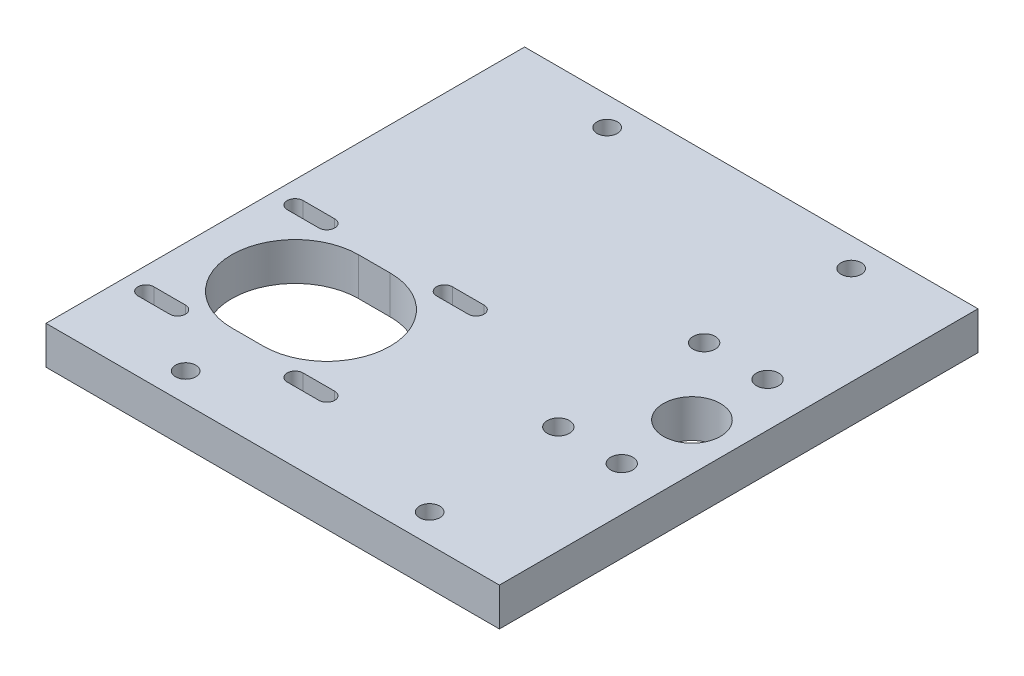
ISO-10303-21;
HEADER;
FILE_DESCRIPTION(('STEP AP214'),'2;1');
FILE_NAME('part.step','',(''),(''),'','','');
FILE_SCHEMA(('AUTOMOTIVE_DESIGN { 1 0 10303 214 1 1 1 1 }'));
ENDSEC;
DATA;
#1=APPLICATION_CONTEXT('core data for automotive mechanical design processes');
#2=APPLICATION_PROTOCOL_DEFINITION('international standard','automotive_design',2000,#1);
#3=PRODUCT_CONTEXT('',#1,'mechanical');
#4=PRODUCT('Part','Part','',(#3));
#5=PRODUCT_RELATED_PRODUCT_CATEGORY('part','',(#4));
#6=PRODUCT_DEFINITION_FORMATION('','',#4);
#7=PRODUCT_DEFINITION_CONTEXT('part definition',#1,'design');
#8=PRODUCT_DEFINITION('design','',#6,#7);
#9=PRODUCT_DEFINITION_SHAPE('','',#8);
#10=(LENGTH_UNIT() NAMED_UNIT(*) SI_UNIT(.MILLI.,.METRE.));
#11=(NAMED_UNIT(*) PLANE_ANGLE_UNIT() SI_UNIT($,.RADIAN.));
#12=(NAMED_UNIT(*) SI_UNIT($,.STERADIAN.) SOLID_ANGLE_UNIT());
#13=UNCERTAINTY_MEASURE_WITH_UNIT(LENGTH_MEASURE(1.E-05),#10,'distance_accuracy_value','');
#14=(GEOMETRIC_REPRESENTATION_CONTEXT(3) GLOBAL_UNCERTAINTY_ASSIGNED_CONTEXT((#13)) GLOBAL_UNIT_ASSIGNED_CONTEXT((#10,
#11,#12)) REPRESENTATION_CONTEXT('',''));
#15=CARTESIAN_POINT('',(0.,0.,0.));
#16=DIRECTION('',(0.,0.,1.));
#17=DIRECTION('',(1.,0.,0.));
#18=AXIS2_PLACEMENT_3D('',#15,#16,#17);
#19=CARTESIAN_POINT('',(-73.5,12.,-75.5));
#20=DIRECTION('',(0.,0.,1.));
#21=DIRECTION('',(1.,0.,0.));
#22=AXIS2_PLACEMENT_3D('',#19,#20,#21);
#23=PLANE('',#22);
#24=DIRECTION('',(-1.,0.,0.));
#25=VECTOR('',#24,1.);
#26=CARTESIAN_POINT('',(-73.5,12.,-75.5));
#27=LINE('',#26,#25);
#28=CARTESIAN_POINT('',(54.55,12.,-75.5));
#29=VERTEX_POINT('',#28);
#30=CARTESIAN_POINT('',(-88.5,12.,-75.5));
#31=VERTEX_POINT('',#30);
#32=EDGE_CURVE('E41',#29,#31,#27,.T.);
#33=ORIENTED_EDGE('',*,*,#32,.F.);
#34=DIRECTION('',(0.,1.,0.));
#35=VECTOR('',#34,1.);
#36=CARTESIAN_POINT('',(54.55,0.,-75.5));
#37=LINE('',#36,#35);
#38=CARTESIAN_POINT('',(54.55,0.,-75.5));
#39=VERTEX_POINT('',#38);
#40=EDGE_CURVE('E195',#39,#29,#37,.T.);
#41=ORIENTED_EDGE('',*,*,#40,.F.);
#42=DIRECTION('',(-1.,0.,0.));
#43=VECTOR('',#42,1.);
#44=CARTESIAN_POINT('',(-73.5,0.,-75.5));
#45=LINE('',#44,#43);
#46=CARTESIAN_POINT('',(-88.5,0.,-75.5));
#47=VERTEX_POINT('',#46);
#48=EDGE_CURVE('E205',#39,#47,#45,.T.);
#49=ORIENTED_EDGE('',*,*,#48,.T.);
#50=DIRECTION('',(0.,1.,0.));
#51=VECTOR('',#50,1.);
#52=CARTESIAN_POINT('',(-88.5,0.,-75.5));
#53=LINE('',#52,#51);
#54=EDGE_CURVE('E246',#47,#31,#53,.T.);
#55=ORIENTED_EDGE('',*,*,#54,.T.);
#56=EDGE_LOOP('',(#33,#41,#49,#55));
#57=FACE_BOUND('',#56,.T.);
#58=ADVANCED_FACE('F33',(#57),#23,.F.);
#59=CARTESIAN_POINT('',(-73.5,12.,75.5));
#60=DIRECTION('',(0.,0.,-1.));
#61=DIRECTION('',(-1.,0.,0.));
#62=AXIS2_PLACEMENT_3D('',#59,#60,#61);
#63=PLANE('',#62);
#64=DIRECTION('',(1.,0.,0.));
#65=VECTOR('',#64,1.);
#66=CARTESIAN_POINT('',(-73.5,0.,75.5));
#67=LINE('',#66,#65);
#68=CARTESIAN_POINT('',(-88.5,0.,75.5));
#69=VERTEX_POINT('',#68);
#70=CARTESIAN_POINT('',(54.55,0.,75.5));
#71=VERTEX_POINT('',#70);
#72=EDGE_CURVE('E36',#69,#71,#67,.T.);
#73=ORIENTED_EDGE('',*,*,#72,.T.);
#74=DIRECTION('',(0.,1.,0.));
#75=VECTOR('',#74,1.);
#76=CARTESIAN_POINT('',(54.55,0.,75.5));
#77=LINE('',#76,#75);
#78=CARTESIAN_POINT('',(54.55,12.,75.5));
#79=VERTEX_POINT('',#78);
#80=EDGE_CURVE('E49',#71,#79,#77,.T.);
#81=ORIENTED_EDGE('',*,*,#80,.T.);
#82=DIRECTION('',(1.,0.,0.));
#83=VECTOR('',#82,1.);
#84=CARTESIAN_POINT('',(-73.5,12.,75.5));
#85=LINE('',#84,#83);
#86=CARTESIAN_POINT('',(-88.5,12.,75.5));
#87=VERTEX_POINT('',#86);
#88=EDGE_CURVE('E11',#87,#79,#85,.T.);
#89=ORIENTED_EDGE('',*,*,#88,.F.);
#90=DIRECTION('',(0.,1.,0.));
#91=VECTOR('',#90,1.);
#92=CARTESIAN_POINT('',(-88.5,0.,75.5));
#93=LINE('',#92,#91);
#94=EDGE_CURVE('E226',#69,#87,#93,.T.);
#95=ORIENTED_EDGE('',*,*,#94,.F.);
#96=EDGE_LOOP('',(#73,#81,#89,#95));
#97=FACE_BOUND('',#96,.T.);
#98=ADVANCED_FACE('F451',(#97),#63,.F.);
#99=CARTESIAN_POINT('',(0.,12.,0.));
#100=DIRECTION('',(0.,-1.,0.));
#101=DIRECTION('',(0.,0.,-1.));
#102=AXIS2_PLACEMENT_3D('',#99,#100,#101);
#103=PLANE('',#102);
#104=CARTESIAN_POINT('',(-53.45,12.,66.5));
#105=DIRECTION('',(0.,1.,0.));
#106=DIRECTION('',(0.,0.,1.));
#107=AXIS2_PLACEMENT_3D('',#104,#105,#106);
#108=CIRCLE('',#107,3.19999999999999);
#109=CARTESIAN_POINT('',(-53.45,12.,69.7));
#110=VERTEX_POINT('',#109);
#111=EDGE_CURVE('E433',#110,#110,#108,.T.);
#112=ORIENTED_EDGE('',*,*,#111,.F.);
#113=EDGE_LOOP('',(#112));
#114=FACE_BOUND('',#113,.T.);
#115=CARTESIAN_POINT('',(-53.45,12.,-66.5));
#116=DIRECTION('',(0.,1.,0.));
#117=DIRECTION('',(0.,0.,-1.));
#118=AXIS2_PLACEMENT_3D('',#115,#116,#117);
#119=CIRCLE('',#118,3.19999999999999);
#120=CARTESIAN_POINT('',(-53.45,12.,-69.7));
#121=VERTEX_POINT('',#120);
#122=EDGE_CURVE('E427',#121,#121,#119,.T.);
#123=ORIENTED_EDGE('',*,*,#122,.F.);
#124=EDGE_LOOP('',(#123));
#125=FACE_BOUND('',#124,.T.);
#126=CARTESIAN_POINT('',(23.55,12.,-66.5));
#127=DIRECTION('',(0.,1.,0.));
#128=DIRECTION('',(0.,0.,-1.));
#129=AXIS2_PLACEMENT_3D('',#126,#127,#128);
#130=CIRCLE('',#129,3.2);
#131=CARTESIAN_POINT('',(23.55,12.,-69.7));
#132=VERTEX_POINT('',#131);
#133=EDGE_CURVE('E421',#132,#132,#130,.T.);
#134=ORIENTED_EDGE('',*,*,#133,.F.);
#135=EDGE_LOOP('',(#134));
#136=FACE_BOUND('',#135,.T.);
#137=CARTESIAN_POINT('',(23.55,12.,66.5));
#138=DIRECTION('',(0.,1.,0.));
#139=DIRECTION('',(0.,0.,1.));
#140=AXIS2_PLACEMENT_3D('',#137,#138,#139);
#141=CIRCLE('',#140,3.2);
#142=CARTESIAN_POINT('',(23.55,12.,69.7));
#143=VERTEX_POINT('',#142);
#144=EDGE_CURVE('E415',#143,#143,#141,.T.);
#145=ORIENTED_EDGE('',*,*,#144,.F.);
#146=EDGE_LOOP('',(#145));
#147=FACE_BOUND('',#146,.T.);
#148=DIRECTION('',(-1.,0.,0.));
#149=VECTOR('',#148,1.);
#150=CARTESIAN_POINT('',(-34.4,12.,53.5));
#151=LINE('',#150,#149);
#152=CARTESIAN_POINT('',(-24.4,12.,53.5));
#153=VERTEX_POINT('',#152);
#154=CARTESIAN_POINT('',(-34.4,12.,53.5));
#155=VERTEX_POINT('',#154);
#156=EDGE_CURVE('E355',#153,#155,#151,.T.);
#157=ORIENTED_EDGE('',*,*,#156,.T.);
#158=CARTESIAN_POINT('',(-34.4,12.,51.));
#159=DIRECTION('',(0.,-1.,0.));
#160=DIRECTION('',(0.,0.,-1.));
#161=AXIS2_PLACEMENT_3D('',#158,#159,#160);
#162=CIRCLE('',#161,2.49999999999998);
#163=CARTESIAN_POINT('',(-34.4,12.,48.5));
#164=VERTEX_POINT('',#163);
#165=EDGE_CURVE('E365',#155,#164,#162,.T.);
#166=ORIENTED_EDGE('',*,*,#165,.T.);
#167=DIRECTION('',(1.,0.,0.));
#168=VECTOR('',#167,1.);
#169=CARTESIAN_POINT('',(-34.4,12.,48.5));
#170=LINE('',#169,#168);
#171=CARTESIAN_POINT('',(-24.4,12.,48.5));
#172=VERTEX_POINT('',#171);
#173=EDGE_CURVE('E377',#164,#172,#170,.T.);
#174=ORIENTED_EDGE('',*,*,#173,.T.);
#175=CARTESIAN_POINT('',(-24.4,12.,51.));
#176=DIRECTION('',(0.,-1.,0.));
#177=DIRECTION('',(0.,0.,1.));
#178=AXIS2_PLACEMENT_3D('',#175,#176,#177);
#179=CIRCLE('',#178,2.49999999999998);
#180=EDGE_CURVE('E57',#172,#153,#179,.T.);
#181=ORIENTED_EDGE('',*,*,#180,.T.);
#182=EDGE_LOOP('',(#157,#166,#174,#181));
#183=FACE_BOUND('',#182,.T.);
#184=DIRECTION('',(1.,0.,0.));
#185=VECTOR('',#184,1.);
#186=CARTESIAN_POINT('',(-34.4,12.,1.40000000000003));
#187=LINE('',#186,#185);
#188=CARTESIAN_POINT('',(-34.4,12.,1.40000000000003));
#189=VERTEX_POINT('',#188);
#190=CARTESIAN_POINT('',(-24.4,12.,1.40000000000003));
#191=VERTEX_POINT('',#190);
#192=EDGE_CURVE('E386',#189,#191,#187,.T.);
#193=ORIENTED_EDGE('',*,*,#192,.T.);
#194=CARTESIAN_POINT('',(-24.4,12.,3.90000000000001));
#195=DIRECTION('',(0.,-1.,0.));
#196=DIRECTION('',(0.,0.,-1.));
#197=AXIS2_PLACEMENT_3D('',#194,#195,#196);
#198=CIRCLE('',#197,2.49999999999998);
#199=CARTESIAN_POINT('',(-24.4,12.,6.4));
#200=VERTEX_POINT('',#199);
#201=EDGE_CURVE('E394',#191,#200,#198,.T.);
#202=ORIENTED_EDGE('',*,*,#201,.T.);
#203=DIRECTION('',(-1.,0.,0.));
#204=VECTOR('',#203,1.);
#205=CARTESIAN_POINT('',(-34.4,12.,6.4));
#206=LINE('',#205,#204);
#207=CARTESIAN_POINT('',(-34.4,12.,6.4));
#208=VERTEX_POINT('',#207);
#209=EDGE_CURVE('E407',#200,#208,#206,.T.);
#210=ORIENTED_EDGE('',*,*,#209,.T.);
#211=CARTESIAN_POINT('',(-34.4,12.,3.90000000000002));
#212=DIRECTION('',(0.,-1.,0.));
#213=DIRECTION('',(0.,0.,1.));
#214=AXIS2_PLACEMENT_3D('',#211,#212,#213);
#215=CIRCLE('',#214,2.49999999999998);
#216=EDGE_CURVE('E404',#208,#189,#215,.T.);
#217=ORIENTED_EDGE('',*,*,#216,.T.);
#218=EDGE_LOOP('',(#193,#202,#210,#217));
#219=FACE_BOUND('',#218,.T.);
#220=DIRECTION('',(-1.,0.,0.));
#221=VECTOR('',#220,1.);
#222=CARTESIAN_POINT('',(-57.95,12.,47.45));
#223=LINE('',#222,#221);
#224=CARTESIAN_POINT('',(-47.95,12.,47.45));
#225=VERTEX_POINT('',#224);
#226=CARTESIAN_POINT('',(-57.95,12.,47.45));
#227=VERTEX_POINT('',#226);
#228=EDGE_CURVE('E291',#225,#227,#223,.T.);
#229=ORIENTED_EDGE('',*,*,#228,.T.);
#230=CARTESIAN_POINT('',(-57.95,12.,27.45));
#231=DIRECTION('',(0.,-1.,0.));
#232=DIRECTION('',(0.,0.,-1.));
#233=AXIS2_PLACEMENT_3D('',#230,#231,#232);
#234=CIRCLE('',#233,20.);
#235=CARTESIAN_POINT('',(-57.95,12.,7.45000000000002));
#236=VERTEX_POINT('',#235);
#237=EDGE_CURVE('E301',#227,#236,#234,.T.);
#238=ORIENTED_EDGE('',*,*,#237,.T.);
#239=DIRECTION('',(1.,0.,0.));
#240=VECTOR('',#239,1.);
#241=CARTESIAN_POINT('',(-57.95,12.,7.45000000000002));
#242=LINE('',#241,#240);
#243=CARTESIAN_POINT('',(-47.95,12.,7.45000000000002));
#244=VERTEX_POINT('',#243);
#245=EDGE_CURVE('E316',#236,#244,#242,.T.);
#246=ORIENTED_EDGE('',*,*,#245,.T.);
#247=CARTESIAN_POINT('',(-47.95,12.,27.45));
#248=DIRECTION('',(0.,-1.,0.));
#249=DIRECTION('',(0.,0.,1.));
#250=AXIS2_PLACEMENT_3D('',#247,#248,#249);
#251=CIRCLE('',#250,20.);
#252=EDGE_CURVE('E313',#244,#225,#251,.T.);
#253=ORIENTED_EDGE('',*,*,#252,.T.);
#254=EDGE_LOOP('',(#229,#238,#246,#253));
#255=FACE_BOUND('',#254,.T.);
#256=DIRECTION('',(1.,0.,0.));
#257=VECTOR('',#256,1.);
#258=CARTESIAN_POINT('',(-71.5,12.,1.40000000000003));
#259=LINE('',#258,#257);
#260=CARTESIAN_POINT('',(-81.5,12.,1.40000000000003));
#261=VERTEX_POINT('',#260);
#262=CARTESIAN_POINT('',(-71.5,12.,1.40000000000003));
#263=VERTEX_POINT('',#262);
#264=EDGE_CURVE('E325',#261,#263,#259,.T.);
#265=ORIENTED_EDGE('',*,*,#264,.T.);
#266=CARTESIAN_POINT('',(-71.5,12.,3.90000000000004));
#267=DIRECTION('',(0.,-1.,0.));
#268=DIRECTION('',(0.,0.,-1.));
#269=AXIS2_PLACEMENT_3D('',#266,#267,#268);
#270=CIRCLE('',#269,2.49999999999998);
#271=CARTESIAN_POINT('',(-71.5,12.,6.4));
#272=VERTEX_POINT('',#271);
#273=EDGE_CURVE('E333',#263,#272,#270,.T.);
#274=ORIENTED_EDGE('',*,*,#273,.T.);
#275=DIRECTION('',(-1.,0.,0.));
#276=VECTOR('',#275,1.);
#277=CARTESIAN_POINT('',(-71.5,12.,6.4));
#278=LINE('',#277,#276);
#279=CARTESIAN_POINT('',(-81.5,12.,6.4));
#280=VERTEX_POINT('',#279);
#281=EDGE_CURVE('E346',#272,#280,#278,.T.);
#282=ORIENTED_EDGE('',*,*,#281,.T.);
#283=CARTESIAN_POINT('',(-81.5,12.,3.90000000000001));
#284=DIRECTION('',(0.,-1.,0.));
#285=DIRECTION('',(0.,0.,1.));
#286=AXIS2_PLACEMENT_3D('',#283,#284,#285);
#287=CIRCLE('',#286,2.49999999999998);
#288=EDGE_CURVE('E343',#280,#261,#287,.T.);
#289=ORIENTED_EDGE('',*,*,#288,.T.);
#290=EDGE_LOOP('',(#265,#274,#282,#289));
#291=FACE_BOUND('',#290,.T.);
#292=DIRECTION('',(1.,0.,0.));
#293=VECTOR('',#292,1.);
#294=CARTESIAN_POINT('',(-71.5,12.,48.5));
#295=LINE('',#294,#293);
#296=CARTESIAN_POINT('',(-81.5,12.,48.5));
#297=VERTEX_POINT('',#296);
#298=CARTESIAN_POINT('',(-71.5,12.,48.5));
#299=VERTEX_POINT('',#298);
#300=EDGE_CURVE('E259',#297,#299,#295,.T.);
#301=ORIENTED_EDGE('',*,*,#300,.T.);
#302=CARTESIAN_POINT('',(-71.5,12.,51.));
#303=DIRECTION('',(0.,-1.,0.));
#304=DIRECTION('',(0.,0.,1.));
#305=AXIS2_PLACEMENT_3D('',#302,#303,#304);
#306=CIRCLE('',#305,2.49999999999998);
#307=CARTESIAN_POINT('',(-71.5,12.,53.5));
#308=VERTEX_POINT('',#307);
#309=EDGE_CURVE('E267',#299,#308,#306,.T.);
#310=ORIENTED_EDGE('',*,*,#309,.T.);
#311=DIRECTION('',(-1.,0.,0.));
#312=VECTOR('',#311,1.);
#313=CARTESIAN_POINT('',(-71.5,12.,53.5));
#314=LINE('',#313,#312);
#315=CARTESIAN_POINT('',(-81.5,12.,53.5));
#316=VERTEX_POINT('',#315);
#317=EDGE_CURVE('E282',#308,#316,#314,.T.);
#318=ORIENTED_EDGE('',*,*,#317,.T.);
#319=CARTESIAN_POINT('',(-81.5,12.,51.));
#320=DIRECTION('',(0.,-1.,0.));
#321=DIRECTION('',(0.,0.,-1.));
#322=AXIS2_PLACEMENT_3D('',#319,#320,#321);
#323=CIRCLE('',#322,2.49999999999998);
#324=EDGE_CURVE('E279',#316,#297,#323,.T.);
#325=ORIENTED_EDGE('',*,*,#324,.T.);
#326=EDGE_LOOP('',(#301,#310,#318,#325));
#327=FACE_BOUND('',#326,.T.);
#328=CARTESIAN_POINT('',(20.65,12.,22.9999999999996));
#329=DIRECTION('',(0.,1.,0.));
#330=DIRECTION('',(0.,0.,1.));
#331=AXIS2_PLACEMENT_3D('',#328,#329,#330);
#332=CIRCLE('',#331,3.49999999999999);
#333=CARTESIAN_POINT('',(20.65,12.,26.4999999999996));
#334=VERTEX_POINT('',#333);
#335=EDGE_CURVE('E241',#334,#334,#332,.T.);
#336=ORIENTED_EDGE('',*,*,#335,.F.);
#337=EDGE_LOOP('',(#336));
#338=FACE_BOUND('',#337,.T.);
#339=CARTESIAN_POINT('',(40.65,12.,22.9999999999996));
#340=DIRECTION('',(0.,1.,0.));
#341=DIRECTION('',(0.,0.,1.));
#342=AXIS2_PLACEMENT_3D('',#339,#340,#341);
#343=CIRCLE('',#342,3.49999999999999);
#344=CARTESIAN_POINT('',(40.65,12.,26.4999999999996));
#345=VERTEX_POINT('',#344);
#346=EDGE_CURVE('E235',#345,#345,#343,.T.);
#347=ORIENTED_EDGE('',*,*,#346,.F.);
#348=EDGE_LOOP('',(#347));
#349=FACE_BOUND('',#348,.T.);
#350=CARTESIAN_POINT('',(40.65,12.,-23.0000000000004));
#351=DIRECTION('',(0.,1.,0.));
#352=DIRECTION('',(0.,0.,1.));
#353=AXIS2_PLACEMENT_3D('',#350,#351,#352);
#354=CIRCLE('',#353,3.49999999999999);
#355=CARTESIAN_POINT('',(40.65,12.,-19.5000000000004));
#356=VERTEX_POINT('',#355);
#357=EDGE_CURVE('E229',#356,#356,#354,.T.);
#358=ORIENTED_EDGE('',*,*,#357,.F.);
#359=EDGE_LOOP('',(#358));
#360=FACE_BOUND('',#359,.T.);
#361=CARTESIAN_POINT('',(20.65,12.,-23.0000000000004));
#362=DIRECTION('',(0.,1.,0.));
#363=DIRECTION('',(0.,0.,1.));
#364=AXIS2_PLACEMENT_3D('',#361,#362,#363);
#365=CIRCLE('',#364,3.49999999999999);
#366=CARTESIAN_POINT('',(20.65,12.,-19.5000000000004));
#367=VERTEX_POINT('',#366);
#368=EDGE_CURVE('E222',#367,#367,#365,.T.);
#369=ORIENTED_EDGE('',*,*,#368,.F.);
#370=EDGE_LOOP('',(#369));
#371=FACE_BOUND('',#370,.T.);
#372=CARTESIAN_POINT('',(39.8,12.,-4.44089209850063E-13));
#373=DIRECTION('',(0.,1.,0.));
#374=DIRECTION('',(0.,0.,1.));
#375=AXIS2_PLACEMENT_3D('',#372,#373,#374);
#376=CIRCLE('',#375,9.);
#377=CARTESIAN_POINT('',(39.8,12.,8.99999999999956));
#378=VERTEX_POINT('',#377);
#379=EDGE_CURVE('E215',#378,#378,#376,.T.);
#380=ORIENTED_EDGE('',*,*,#379,.F.);
#381=EDGE_LOOP('',(#380));
#382=FACE_BOUND('',#381,.T.);
#383=ORIENTED_EDGE('',*,*,#88,.T.);
#384=DIRECTION('',(0.,0.,1.));
#385=VECTOR('',#384,1.);
#386=CARTESIAN_POINT('',(54.55,12.,-75.5));
#387=LINE('',#386,#385);
#388=EDGE_CURVE('E200',#29,#79,#387,.T.);
#389=ORIENTED_EDGE('',*,*,#388,.F.);
#390=ORIENTED_EDGE('',*,*,#32,.T.);
#391=DIRECTION('',(0.,0.,1.));
#392=VECTOR('',#391,1.);
#393=CARTESIAN_POINT('',(-88.5,12.,-75.5));
#394=LINE('',#393,#392);
#395=EDGE_CURVE('E250',#31,#87,#394,.T.);
#396=ORIENTED_EDGE('',*,*,#395,.T.);
#397=EDGE_LOOP('',(#383,#389,#390,#396));
#398=FACE_BOUND('',#397,.T.);
#399=ADVANCED_FACE('F448',(#114,#125,#136,#147,#183,#219,#255,#291,#327,#338,#349,#360,#371,
#382,#398),#103,.F.);
#400=CARTESIAN_POINT('',(0.,0.,0.));
#401=DIRECTION('',(0.,-1.,0.));
#402=DIRECTION('',(0.,0.,-1.));
#403=AXIS2_PLACEMENT_3D('',#400,#401,#402);
#404=PLANE('',#403);
#405=CARTESIAN_POINT('',(-53.45,0.,66.5));
#406=DIRECTION('',(0.,1.,0.));
#407=DIRECTION('',(0.,0.,1.));
#408=AXIS2_PLACEMENT_3D('',#405,#406,#407);
#409=CIRCLE('',#408,3.19999999999999);
#410=CARTESIAN_POINT('',(-53.45,0.,69.7));
#411=VERTEX_POINT('',#410);
#412=EDGE_CURVE('E418',#411,#411,#409,.T.);
#413=ORIENTED_EDGE('',*,*,#412,.T.);
#414=EDGE_LOOP('',(#413));
#415=FACE_BOUND('',#414,.T.);
#416=CARTESIAN_POINT('',(-53.45,0.,-66.5));
#417=DIRECTION('',(0.,1.,0.));
#418=DIRECTION('',(0.,0.,-1.));
#419=AXIS2_PLACEMENT_3D('',#416,#417,#418);
#420=CIRCLE('',#419,3.19999999999999);
#421=CARTESIAN_POINT('',(-53.45,0.,-69.7));
#422=VERTEX_POINT('',#421);
#423=EDGE_CURVE('E430',#422,#422,#420,.T.);
#424=ORIENTED_EDGE('',*,*,#423,.T.);
#425=EDGE_LOOP('',(#424));
#426=FACE_BOUND('',#425,.T.);
#427=CARTESIAN_POINT('',(23.55,0.,-66.5));
#428=DIRECTION('',(0.,1.,0.));
#429=DIRECTION('',(0.,0.,-1.));
#430=AXIS2_PLACEMENT_3D('',#427,#428,#429);
#431=CIRCLE('',#430,3.2);
#432=CARTESIAN_POINT('',(23.55,0.,-69.7));
#433=VERTEX_POINT('',#432);
#434=EDGE_CURVE('E424',#433,#433,#431,.T.);
#435=ORIENTED_EDGE('',*,*,#434,.T.);
#436=EDGE_LOOP('',(#435));
#437=FACE_BOUND('',#436,.T.);
#438=CARTESIAN_POINT('',(23.55,0.,66.5));
#439=DIRECTION('',(0.,1.,0.));
#440=DIRECTION('',(0.,0.,1.));
#441=AXIS2_PLACEMENT_3D('',#438,#439,#440);
#442=CIRCLE('',#441,3.2);
#443=CARTESIAN_POINT('',(23.55,0.,69.7));
#444=VERTEX_POINT('',#443);
#445=EDGE_CURVE('E413',#444,#444,#442,.T.);
#446=ORIENTED_EDGE('',*,*,#445,.T.);
#447=EDGE_LOOP('',(#446));
#448=FACE_BOUND('',#447,.T.);
#449=DIRECTION('',(0.,0.,1.));
#450=VECTOR('',#449,1.);
#451=CARTESIAN_POINT('',(54.55,0.,-75.5));
#452=LINE('',#451,#450);
#453=EDGE_CURVE('E192',#39,#71,#452,.T.);
#454=ORIENTED_EDGE('',*,*,#453,.T.);
#455=ORIENTED_EDGE('',*,*,#72,.F.);
#456=DIRECTION('',(0.,0.,1.));
#457=VECTOR('',#456,1.);
#458=CARTESIAN_POINT('',(-88.5,0.,-75.5));
#459=LINE('',#458,#457);
#460=EDGE_CURVE('E212',#47,#69,#459,.T.);
#461=ORIENTED_EDGE('',*,*,#460,.F.);
#462=ORIENTED_EDGE('',*,*,#48,.F.);
#463=EDGE_LOOP('',(#454,#455,#461,#462));
#464=FACE_BOUND('',#463,.T.);
#465=CARTESIAN_POINT('',(-34.4,0.,51.));
#466=DIRECTION('',(0.,-1.,0.));
#467=DIRECTION('',(0.,0.,-1.));
#468=AXIS2_PLACEMENT_3D('',#465,#466,#467);
#469=CIRCLE('',#468,2.49999999999998);
#470=CARTESIAN_POINT('',(-34.4,0.,53.5));
#471=VERTEX_POINT('',#470);
#472=CARTESIAN_POINT('',(-34.4,0.,48.5));
#473=VERTEX_POINT('',#472);
#474=EDGE_CURVE('E372',#471,#473,#469,.T.);
#475=ORIENTED_EDGE('',*,*,#474,.F.);
#476=DIRECTION('',(-1.,0.,0.));
#477=VECTOR('',#476,1.);
#478=CARTESIAN_POINT('',(-34.4,0.,53.5));
#479=LINE('',#478,#477);
#480=CARTESIAN_POINT('',(-24.4,0.,53.5));
#481=VERTEX_POINT('',#480);
#482=EDGE_CURVE('E362',#481,#471,#479,.T.);
#483=ORIENTED_EDGE('',*,*,#482,.F.);
#484=CARTESIAN_POINT('',(-24.4,0.,51.));
#485=DIRECTION('',(0.,-1.,0.));
#486=DIRECTION('',(0.,0.,1.));
#487=AXIS2_PLACEMENT_3D('',#484,#485,#486);
#488=CIRCLE('',#487,2.49999999999998);
#489=CARTESIAN_POINT('',(-24.4,0.,48.5));
#490=VERTEX_POINT('',#489);
#491=EDGE_CURVE('E366',#490,#481,#488,.T.);
#492=ORIENTED_EDGE('',*,*,#491,.F.);
#493=DIRECTION('',(1.,0.,0.));
#494=VECTOR('',#493,1.);
#495=CARTESIAN_POINT('',(-34.4,0.,48.5));
#496=LINE('',#495,#494);
#497=EDGE_CURVE('E369',#473,#490,#496,.T.);
#498=ORIENTED_EDGE('',*,*,#497,.F.);
#499=EDGE_LOOP('',(#475,#483,#492,#498));
#500=FACE_BOUND('',#499,.T.);
#501=CARTESIAN_POINT('',(-24.4,0.,3.90000000000001));
#502=DIRECTION('',(0.,-1.,0.));
#503=DIRECTION('',(0.,0.,-1.));
#504=AXIS2_PLACEMENT_3D('',#501,#502,#503);
#505=CIRCLE('',#504,2.49999999999998);
#506=CARTESIAN_POINT('',(-24.4,0.,1.40000000000003));
#507=VERTEX_POINT('',#506);
#508=CARTESIAN_POINT('',(-24.4,0.,6.4));
#509=VERTEX_POINT('',#508);
#510=EDGE_CURVE('E361',#507,#509,#505,.T.);
#511=ORIENTED_EDGE('',*,*,#510,.F.);
#512=DIRECTION('',(1.,0.,0.));
#513=VECTOR('',#512,1.);
#514=CARTESIAN_POINT('',(-34.4,0.,1.40000000000003));
#515=LINE('',#514,#513);
#516=CARTESIAN_POINT('',(-34.4,0.,1.40000000000003));
#517=VERTEX_POINT('',#516);
#518=EDGE_CURVE('E391',#517,#507,#515,.T.);
#519=ORIENTED_EDGE('',*,*,#518,.F.);
#520=CARTESIAN_POINT('',(-34.4,0.,3.90000000000002));
#521=DIRECTION('',(0.,-1.,0.));
#522=DIRECTION('',(0.,0.,1.));
#523=AXIS2_PLACEMENT_3D('',#520,#521,#522);
#524=CIRCLE('',#523,2.49999999999998);
#525=CARTESIAN_POINT('',(-34.4,0.,6.4));
#526=VERTEX_POINT('',#525);
#527=EDGE_CURVE('E395',#526,#517,#524,.T.);
#528=ORIENTED_EDGE('',*,*,#527,.F.);
#529=DIRECTION('',(-1.,0.,0.));
#530=VECTOR('',#529,1.);
#531=CARTESIAN_POINT('',(-34.4,0.,6.4));
#532=LINE('',#531,#530);
#533=EDGE_CURVE('E398',#509,#526,#532,.T.);
#534=ORIENTED_EDGE('',*,*,#533,.F.);
#535=EDGE_LOOP('',(#511,#519,#528,#534));
#536=FACE_BOUND('',#535,.T.);
#537=CARTESIAN_POINT('',(-57.95,0.,27.45));
#538=DIRECTION('',(0.,-1.,0.));
#539=DIRECTION('',(0.,0.,-1.));
#540=AXIS2_PLACEMENT_3D('',#537,#538,#539);
#541=CIRCLE('',#540,20.);
#542=CARTESIAN_POINT('',(-57.95,0.,47.45));
#543=VERTEX_POINT('',#542);
#544=CARTESIAN_POINT('',(-57.95,0.,7.45000000000002));
#545=VERTEX_POINT('',#544);
#546=EDGE_CURVE('E308',#543,#545,#541,.T.);
#547=ORIENTED_EDGE('',*,*,#546,.F.);
#548=DIRECTION('',(-1.,0.,0.));
#549=VECTOR('',#548,1.);
#550=CARTESIAN_POINT('',(-57.95,0.,47.45));
#551=LINE('',#550,#549);
#552=CARTESIAN_POINT('',(-47.95,0.,47.45));
#553=VERTEX_POINT('',#552);
#554=EDGE_CURVE('E298',#553,#543,#551,.T.);
#555=ORIENTED_EDGE('',*,*,#554,.F.);
#556=CARTESIAN_POINT('',(-47.95,0.,27.45));
#557=DIRECTION('',(0.,-1.,0.));
#558=DIRECTION('',(0.,0.,1.));
#559=AXIS2_PLACEMENT_3D('',#556,#557,#558);
#560=CIRCLE('',#559,20.);
#561=CARTESIAN_POINT('',(-47.95,0.,7.45000000000002));
#562=VERTEX_POINT('',#561);
#563=EDGE_CURVE('E302',#562,#553,#560,.T.);
#564=ORIENTED_EDGE('',*,*,#563,.F.);
#565=DIRECTION('',(1.,0.,0.));
#566=VECTOR('',#565,1.);
#567=CARTESIAN_POINT('',(-57.95,0.,7.45000000000002));
#568=LINE('',#567,#566);
#569=EDGE_CURVE('E305',#545,#562,#568,.T.);
#570=ORIENTED_EDGE('',*,*,#569,.F.);
#571=EDGE_LOOP('',(#547,#555,#564,#570));
#572=FACE_BOUND('',#571,.T.);
#573=CARTESIAN_POINT('',(-71.5,0.,3.90000000000004));
#574=DIRECTION('',(0.,-1.,0.));
#575=DIRECTION('',(0.,0.,-1.));
#576=AXIS2_PLACEMENT_3D('',#573,#574,#575);
#577=CIRCLE('',#576,2.49999999999998);
#578=CARTESIAN_POINT('',(-71.5,0.,1.40000000000003));
#579=VERTEX_POINT('',#578);
#580=CARTESIAN_POINT('',(-71.5,0.,6.4));
#581=VERTEX_POINT('',#580);
#582=EDGE_CURVE('E297',#579,#581,#577,.T.);
#583=ORIENTED_EDGE('',*,*,#582,.F.);
#584=DIRECTION('',(1.,0.,0.));
#585=VECTOR('',#584,1.);
#586=CARTESIAN_POINT('',(-71.5,0.,1.40000000000003));
#587=LINE('',#586,#585);
#588=CARTESIAN_POINT('',(-81.5,0.,1.40000000000003));
#589=VERTEX_POINT('',#588);
#590=EDGE_CURVE('E330',#589,#579,#587,.T.);
#591=ORIENTED_EDGE('',*,*,#590,.F.);
#592=CARTESIAN_POINT('',(-81.5,0.,3.90000000000001));
#593=DIRECTION('',(0.,-1.,0.));
#594=DIRECTION('',(0.,0.,1.));
#595=AXIS2_PLACEMENT_3D('',#592,#593,#594);
#596=CIRCLE('',#595,2.49999999999998);
#597=CARTESIAN_POINT('',(-81.5,0.,6.39999999999999));
#598=VERTEX_POINT('',#597);
#599=EDGE_CURVE('E334',#598,#589,#596,.T.);
#600=ORIENTED_EDGE('',*,*,#599,.F.);
#601=DIRECTION('',(-1.,0.,0.));
#602=VECTOR('',#601,1.);
#603=CARTESIAN_POINT('',(-71.5,0.,6.4));
#604=LINE('',#603,#602);
#605=EDGE_CURVE('E337',#581,#598,#604,.T.);
#606=ORIENTED_EDGE('',*,*,#605,.F.);
#607=EDGE_LOOP('',(#583,#591,#600,#606));
#608=FACE_BOUND('',#607,.T.);
#609=CARTESIAN_POINT('',(-71.5,0.,51.));
#610=DIRECTION('',(0.,-1.,0.));
#611=DIRECTION('',(0.,0.,1.));
#612=AXIS2_PLACEMENT_3D('',#609,#610,#611);
#613=CIRCLE('',#612,2.49999999999998);
#614=CARTESIAN_POINT('',(-71.5,0.,48.5));
#615=VERTEX_POINT('',#614);
#616=CARTESIAN_POINT('',(-71.5,0.,53.5));
#617=VERTEX_POINT('',#616);
#618=EDGE_CURVE('E274',#615,#617,#613,.T.);
#619=ORIENTED_EDGE('',*,*,#618,.F.);
#620=DIRECTION('',(1.,0.,0.));
#621=VECTOR('',#620,1.);
#622=CARTESIAN_POINT('',(-71.5,0.,48.5));
#623=LINE('',#622,#621);
#624=CARTESIAN_POINT('',(-81.5,0.,48.5));
#625=VERTEX_POINT('',#624);
#626=EDGE_CURVE('E264',#625,#615,#623,.T.);
#627=ORIENTED_EDGE('',*,*,#626,.F.);
#628=CARTESIAN_POINT('',(-81.5,0.,51.));
#629=DIRECTION('',(0.,-1.,0.));
#630=DIRECTION('',(0.,0.,-1.));
#631=AXIS2_PLACEMENT_3D('',#628,#629,#630);
#632=CIRCLE('',#631,2.49999999999998);
#633=CARTESIAN_POINT('',(-81.5,0.,53.5));
#634=VERTEX_POINT('',#633);
#635=EDGE_CURVE('E268',#634,#625,#632,.T.);
#636=ORIENTED_EDGE('',*,*,#635,.F.);
#637=DIRECTION('',(-1.,0.,0.));
#638=VECTOR('',#637,1.);
#639=CARTESIAN_POINT('',(-71.5,0.,53.5));
#640=LINE('',#639,#638);
#641=EDGE_CURVE('E271',#617,#634,#640,.T.);
#642=ORIENTED_EDGE('',*,*,#641,.F.);
#643=EDGE_LOOP('',(#619,#627,#636,#642));
#644=FACE_BOUND('',#643,.T.);
#645=CARTESIAN_POINT('',(20.65,0.,22.9999999999996));
#646=DIRECTION('',(0.,1.,0.));
#647=DIRECTION('',(0.,0.,1.));
#648=AXIS2_PLACEMENT_3D('',#645,#646,#647);
#649=CIRCLE('',#648,3.49999999999999);
#650=CARTESIAN_POINT('',(20.65,0.,26.4999999999996));
#651=VERTEX_POINT('',#650);
#652=EDGE_CURVE('E220',#651,#651,#649,.T.);
#653=ORIENTED_EDGE('',*,*,#652,.T.);
#654=EDGE_LOOP('',(#653));
#655=FACE_BOUND('',#654,.T.);
#656=CARTESIAN_POINT('',(40.65,0.,22.9999999999996));
#657=DIRECTION('',(0.,1.,0.));
#658=DIRECTION('',(0.,0.,1.));
#659=AXIS2_PLACEMENT_3D('',#656,#657,#658);
#660=CIRCLE('',#659,3.49999999999999);
#661=CARTESIAN_POINT('',(40.65,0.,26.4999999999996));
#662=VERTEX_POINT('',#661);
#663=EDGE_CURVE('E238',#662,#662,#660,.T.);
#664=ORIENTED_EDGE('',*,*,#663,.T.);
#665=EDGE_LOOP('',(#664));
#666=FACE_BOUND('',#665,.T.);
#667=CARTESIAN_POINT('',(40.65,0.,-23.0000000000004));
#668=DIRECTION('',(0.,1.,0.));
#669=DIRECTION('',(0.,0.,1.));
#670=AXIS2_PLACEMENT_3D('',#667,#668,#669);
#671=CIRCLE('',#670,3.49999999999999);
#672=CARTESIAN_POINT('',(40.65,0.,-19.5000000000004));
#673=VERTEX_POINT('',#672);
#674=EDGE_CURVE('E232',#673,#673,#671,.T.);
#675=ORIENTED_EDGE('',*,*,#674,.T.);
#676=EDGE_LOOP('',(#675));
#677=FACE_BOUND('',#676,.T.);
#678=CARTESIAN_POINT('',(20.65,0.,-23.0000000000004));
#679=DIRECTION('',(0.,1.,0.));
#680=DIRECTION('',(0.,0.,1.));
#681=AXIS2_PLACEMENT_3D('',#678,#679,#680);
#682=CIRCLE('',#681,3.49999999999999);
#683=CARTESIAN_POINT('',(20.65,0.,-19.5000000000004));
#684=VERTEX_POINT('',#683);
#685=EDGE_CURVE('E225',#684,#684,#682,.T.);
#686=ORIENTED_EDGE('',*,*,#685,.T.);
#687=EDGE_LOOP('',(#686));
#688=FACE_BOUND('',#687,.T.);
#689=CARTESIAN_POINT('',(39.8,0.,-4.44089209850063E-13));
#690=DIRECTION('',(0.,1.,0.));
#691=DIRECTION('',(0.,0.,1.));
#692=AXIS2_PLACEMENT_3D('',#689,#690,#691);
#693=CIRCLE('',#692,9.);
#694=CARTESIAN_POINT('',(39.8,0.,8.99999999999956));
#695=VERTEX_POINT('',#694);
#696=EDGE_CURVE('E213',#695,#695,#693,.T.);
#697=ORIENTED_EDGE('',*,*,#696,.T.);
#698=EDGE_LOOP('',(#697));
#699=FACE_BOUND('',#698,.T.);
#700=ADVANCED_FACE('F209',(#415,#426,#437,#448,#464,#500,#536,#572,#608,#644,#655,#666,#677,
#688,#699),#404,.T.);
#701=CARTESIAN_POINT('',(39.8,0.,-4.44089209850063E-13));
#702=DIRECTION('',(0.,1.,0.));
#703=DIRECTION('',(0.,0.,1.));
#704=AXIS2_PLACEMENT_3D('',#701,#702,#703);
#705=CYLINDRICAL_SURFACE('',#704,9.);
#706=ORIENTED_EDGE('',*,*,#696,.F.);
#707=EDGE_LOOP('',(#706));
#708=FACE_BOUND('',#707,.T.);
#709=ORIENTED_EDGE('',*,*,#379,.T.);
#710=EDGE_LOOP('',(#709));
#711=FACE_BOUND('',#710,.T.);
#712=ADVANCED_FACE('F506',(#708,#711),#705,.F.);
#713=CARTESIAN_POINT('',(20.65,0.,-23.0000000000004));
#714=DIRECTION('',(0.,1.,0.));
#715=DIRECTION('',(0.,0.,1.));
#716=AXIS2_PLACEMENT_3D('',#713,#714,#715);
#717=CYLINDRICAL_SURFACE('',#716,3.49999999999999);
#718=ORIENTED_EDGE('',*,*,#685,.F.);
#719=EDGE_LOOP('',(#718));
#720=FACE_BOUND('',#719,.T.);
#721=ORIENTED_EDGE('',*,*,#368,.T.);
#722=EDGE_LOOP('',(#721));
#723=FACE_BOUND('',#722,.T.);
#724=ADVANCED_FACE('F510',(#720,#723),#717,.F.);
#725=CARTESIAN_POINT('',(40.65,0.,-23.0000000000004));
#726=DIRECTION('',(0.,1.,0.));
#727=DIRECTION('',(0.,0.,1.));
#728=AXIS2_PLACEMENT_3D('',#725,#726,#727);
#729=CYLINDRICAL_SURFACE('',#728,3.49999999999999);
#730=ORIENTED_EDGE('',*,*,#674,.F.);
#731=EDGE_LOOP('',(#730));
#732=FACE_BOUND('',#731,.T.);
#733=ORIENTED_EDGE('',*,*,#357,.T.);
#734=EDGE_LOOP('',(#733));
#735=FACE_BOUND('',#734,.T.);
#736=ADVANCED_FACE('F514',(#732,#735),#729,.F.);
#737=CARTESIAN_POINT('',(40.65,0.,22.9999999999996));
#738=DIRECTION('',(0.,1.,0.));
#739=DIRECTION('',(0.,0.,1.));
#740=AXIS2_PLACEMENT_3D('',#737,#738,#739);
#741=CYLINDRICAL_SURFACE('',#740,3.49999999999999);
#742=ORIENTED_EDGE('',*,*,#663,.F.);
#743=EDGE_LOOP('',(#742));
#744=FACE_BOUND('',#743,.T.);
#745=ORIENTED_EDGE('',*,*,#346,.T.);
#746=EDGE_LOOP('',(#745));
#747=FACE_BOUND('',#746,.T.);
#748=ADVANCED_FACE('F495',(#744,#747),#741,.F.);
#749=CARTESIAN_POINT('',(20.65,0.,22.9999999999996));
#750=DIRECTION('',(0.,1.,0.));
#751=DIRECTION('',(0.,0.,1.));
#752=AXIS2_PLACEMENT_3D('',#749,#750,#751);
#753=CYLINDRICAL_SURFACE('',#752,3.49999999999999);
#754=ORIENTED_EDGE('',*,*,#652,.F.);
#755=EDGE_LOOP('',(#754));
#756=FACE_BOUND('',#755,.T.);
#757=ORIENTED_EDGE('',*,*,#335,.T.);
#758=EDGE_LOOP('',(#757));
#759=FACE_BOUND('',#758,.T.);
#760=ADVANCED_FACE('F486',(#756,#759),#753,.F.);
#761=CARTESIAN_POINT('',(-88.5,0.,-75.5));
#762=DIRECTION('',(-1.,0.,0.));
#763=DIRECTION('',(0.,0.,1.));
#764=AXIS2_PLACEMENT_3D('',#761,#762,#763);
#765=PLANE('',#764);
#766=ORIENTED_EDGE('',*,*,#395,.F.);
#767=ORIENTED_EDGE('',*,*,#54,.F.);
#768=ORIENTED_EDGE('',*,*,#460,.T.);
#769=ORIENTED_EDGE('',*,*,#94,.T.);
#770=EDGE_LOOP('',(#766,#767,#768,#769));
#771=FACE_BOUND('',#770,.T.);
#772=ADVANCED_FACE('F483',(#771),#765,.T.);
#773=CARTESIAN_POINT('',(-71.5,12.,51.));
#774=DIRECTION('',(0.,-1.,0.));
#775=DIRECTION('',(0.,0.,-1.));
#776=AXIS2_PLACEMENT_3D('',#773,#774,#775);
#777=CYLINDRICAL_SURFACE('',#776,2.49999999999998);
#778=ORIENTED_EDGE('',*,*,#618,.T.);
#779=DIRECTION('',(0.,-1.,0.));
#780=VECTOR('',#779,1.);
#781=CARTESIAN_POINT('',(-71.5,12.,53.5));
#782=LINE('',#781,#780);
#783=EDGE_CURVE('E255',#308,#617,#782,.T.);
#784=ORIENTED_EDGE('',*,*,#783,.F.);
#785=ORIENTED_EDGE('',*,*,#309,.F.);
#786=DIRECTION('',(0.,-1.,0.));
#787=VECTOR('',#786,1.);
#788=CARTESIAN_POINT('',(-71.5,12.,48.5));
#789=LINE('',#788,#787);
#790=EDGE_CURVE('E253',#299,#615,#789,.T.);
#791=ORIENTED_EDGE('',*,*,#790,.T.);
#792=EDGE_LOOP('',(#778,#784,#785,#791));
#793=FACE_BOUND('',#792,.T.);
#794=ADVANCED_FACE('F485',(#793),#777,.F.);
#795=CARTESIAN_POINT('',(-71.5,12.,48.5));
#796=DIRECTION('',(0.,0.,-1.));
#797=DIRECTION('',(-1.,0.,0.));
#798=AXIS2_PLACEMENT_3D('',#795,#796,#797);
#799=PLANE('',#798);
#800=ORIENTED_EDGE('',*,*,#626,.T.);
#801=ORIENTED_EDGE('',*,*,#790,.F.);
#802=ORIENTED_EDGE('',*,*,#300,.F.);
#803=DIRECTION('',(0.,-1.,0.));
#804=VECTOR('',#803,1.);
#805=CARTESIAN_POINT('',(-81.5,12.,48.5));
#806=LINE('',#805,#804);
#807=EDGE_CURVE('E261',#297,#625,#806,.T.);
#808=ORIENTED_EDGE('',*,*,#807,.T.);
#809=EDGE_LOOP('',(#800,#801,#802,#808));
#810=FACE_BOUND('',#809,.T.);
#811=ADVANCED_FACE('F492',(#810),#799,.F.);
#812=CARTESIAN_POINT('',(-81.5,12.,51.));
#813=DIRECTION('',(0.,-1.,0.));
#814=DIRECTION('',(0.,0.,-1.));
#815=AXIS2_PLACEMENT_3D('',#812,#813,#814);
#816=CYLINDRICAL_SURFACE('',#815,2.49999999999998);
#817=ORIENTED_EDGE('',*,*,#635,.T.);
#818=ORIENTED_EDGE('',*,*,#807,.F.);
#819=ORIENTED_EDGE('',*,*,#324,.F.);
#820=DIRECTION('',(0.,-1.,0.));
#821=VECTOR('',#820,1.);
#822=CARTESIAN_POINT('',(-81.5,12.,53.5));
#823=LINE('',#822,#821);
#824=EDGE_CURVE('E258',#316,#634,#823,.T.);
#825=ORIENTED_EDGE('',*,*,#824,.T.);
#826=EDGE_LOOP('',(#817,#818,#819,#825));
#827=FACE_BOUND('',#826,.T.);
#828=ADVANCED_FACE('F562',(#827),#816,.F.);
#829=CARTESIAN_POINT('',(-71.5,12.,53.5));
#830=DIRECTION('',(0.,0.,1.));
#831=DIRECTION('',(1.,0.,0.));
#832=AXIS2_PLACEMENT_3D('',#829,#830,#831);
#833=PLANE('',#832);
#834=ORIENTED_EDGE('',*,*,#641,.T.);
#835=ORIENTED_EDGE('',*,*,#824,.F.);
#836=ORIENTED_EDGE('',*,*,#317,.F.);
#837=ORIENTED_EDGE('',*,*,#783,.T.);
#838=EDGE_LOOP('',(#834,#835,#836,#837));
#839=FACE_BOUND('',#838,.T.);
#840=ADVANCED_FACE('F572',(#839),#833,.F.);
#841=CARTESIAN_POINT('',(-71.5,12.,3.90000000000004));
#842=DIRECTION('',(0.,-1.,0.));
#843=DIRECTION('',(0.,0.,-1.));
#844=AXIS2_PLACEMENT_3D('',#841,#842,#843);
#845=CYLINDRICAL_SURFACE('',#844,2.49999999999998);
#846=ORIENTED_EDGE('',*,*,#582,.T.);
#847=DIRECTION('',(0.,-1.,0.));
#848=VECTOR('',#847,1.);
#849=CARTESIAN_POINT('',(-71.5,12.,6.4));
#850=LINE('',#849,#848);
#851=EDGE_CURVE('E321',#272,#581,#850,.T.);
#852=ORIENTED_EDGE('',*,*,#851,.F.);
#853=ORIENTED_EDGE('',*,*,#273,.F.);
#854=DIRECTION('',(0.,-1.,0.));
#855=VECTOR('',#854,1.);
#856=CARTESIAN_POINT('',(-71.5,12.,1.40000000000003));
#857=LINE('',#856,#855);
#858=EDGE_CURVE('E276',#263,#579,#857,.T.);
#859=ORIENTED_EDGE('',*,*,#858,.T.);
#860=EDGE_LOOP('',(#846,#852,#853,#859));
#861=FACE_BOUND('',#860,.T.);
#862=ADVANCED_FACE('F582',(#861),#845,.F.);
#863=CARTESIAN_POINT('',(-71.5,12.,1.40000000000003));
#864=DIRECTION('',(0.,0.,-1.));
#865=DIRECTION('',(-1.,0.,0.));
#866=AXIS2_PLACEMENT_3D('',#863,#864,#865);
#867=PLANE('',#866);
#868=ORIENTED_EDGE('',*,*,#590,.T.);
#869=ORIENTED_EDGE('',*,*,#858,.F.);
#870=ORIENTED_EDGE('',*,*,#264,.F.);
#871=DIRECTION('',(0.,-1.,0.));
#872=VECTOR('',#871,1.);
#873=CARTESIAN_POINT('',(-81.5,12.,1.40000000000003));
#874=LINE('',#873,#872);
#875=EDGE_CURVE('E327',#261,#589,#874,.T.);
#876=ORIENTED_EDGE('',*,*,#875,.T.);
#877=EDGE_LOOP('',(#868,#869,#870,#876));
#878=FACE_BOUND('',#877,.T.);
#879=ADVANCED_FACE('F592',(#878),#867,.F.);
#880=CARTESIAN_POINT('',(-81.5,12.,3.90000000000001));
#881=DIRECTION('',(0.,-1.,0.));
#882=DIRECTION('',(0.,0.,-1.));
#883=AXIS2_PLACEMENT_3D('',#880,#881,#882);
#884=CYLINDRICAL_SURFACE('',#883,2.49999999999998);
#885=ORIENTED_EDGE('',*,*,#599,.T.);
#886=ORIENTED_EDGE('',*,*,#875,.F.);
#887=ORIENTED_EDGE('',*,*,#288,.F.);
#888=DIRECTION('',(0.,-1.,0.));
#889=VECTOR('',#888,1.);
#890=CARTESIAN_POINT('',(-81.5,12.,6.39999999999999));
#891=LINE('',#890,#889);
#892=EDGE_CURVE('E324',#280,#598,#891,.T.);
#893=ORIENTED_EDGE('',*,*,#892,.T.);
#894=EDGE_LOOP('',(#885,#886,#887,#893));
#895=FACE_BOUND('',#894,.T.);
#896=ADVANCED_FACE('F602',(#895),#884,.F.);
#897=CARTESIAN_POINT('',(-71.5,12.,6.4));
#898=DIRECTION('',(0.,0.,1.));
#899=DIRECTION('',(1.,0.,0.));
#900=AXIS2_PLACEMENT_3D('',#897,#898,#899);
#901=PLANE('',#900);
#902=ORIENTED_EDGE('',*,*,#605,.T.);
#903=ORIENTED_EDGE('',*,*,#892,.F.);
#904=ORIENTED_EDGE('',*,*,#281,.F.);
#905=ORIENTED_EDGE('',*,*,#851,.T.);
#906=EDGE_LOOP('',(#902,#903,#904,#905));
#907=FACE_BOUND('',#906,.T.);
#908=ADVANCED_FACE('F612',(#907),#901,.F.);
#909=CARTESIAN_POINT('',(-57.95,12.,27.45));
#910=DIRECTION('',(0.,-1.,0.));
#911=DIRECTION('',(0.,0.,-1.));
#912=AXIS2_PLACEMENT_3D('',#909,#910,#911);
#913=CYLINDRICAL_SURFACE('',#912,20.);
#914=ORIENTED_EDGE('',*,*,#546,.T.);
#915=DIRECTION('',(0.,-1.,0.));
#916=VECTOR('',#915,1.);
#917=CARTESIAN_POINT('',(-57.95,12.,7.45000000000002));
#918=LINE('',#917,#916);
#919=EDGE_CURVE('E287',#236,#545,#918,.T.);
#920=ORIENTED_EDGE('',*,*,#919,.F.);
#921=ORIENTED_EDGE('',*,*,#237,.F.);
#922=DIRECTION('',(0.,-1.,0.));
#923=VECTOR('',#922,1.);
#924=CARTESIAN_POINT('',(-57.95,12.,47.45));
#925=LINE('',#924,#923);
#926=EDGE_CURVE('E295',#227,#543,#925,.T.);
#927=ORIENTED_EDGE('',*,*,#926,.T.);
#928=EDGE_LOOP('',(#914,#920,#921,#927));
#929=FACE_BOUND('',#928,.T.);
#930=ADVANCED_FACE('F622',(#929),#913,.F.);
#931=CARTESIAN_POINT('',(-57.95,12.,47.45));
#932=DIRECTION('',(0.,0.,1.));
#933=DIRECTION('',(1.,0.,0.));
#934=AXIS2_PLACEMENT_3D('',#931,#932,#933);
#935=PLANE('',#934);
#936=ORIENTED_EDGE('',*,*,#554,.T.);
#937=ORIENTED_EDGE('',*,*,#926,.F.);
#938=ORIENTED_EDGE('',*,*,#228,.F.);
#939=DIRECTION('',(0.,-1.,0.));
#940=VECTOR('',#939,1.);
#941=CARTESIAN_POINT('',(-47.95,12.,47.45));
#942=LINE('',#941,#940);
#943=EDGE_CURVE('E293',#225,#553,#942,.T.);
#944=ORIENTED_EDGE('',*,*,#943,.T.);
#945=EDGE_LOOP('',(#936,#937,#938,#944));
#946=FACE_BOUND('',#945,.T.);
#947=ADVANCED_FACE('F632',(#946),#935,.F.);
#948=CARTESIAN_POINT('',(-47.95,12.,27.45));
#949=DIRECTION('',(0.,-1.,0.));
#950=DIRECTION('',(0.,0.,-1.));
#951=AXIS2_PLACEMENT_3D('',#948,#949,#950);
#952=CYLINDRICAL_SURFACE('',#951,20.);
#953=ORIENTED_EDGE('',*,*,#563,.T.);
#954=ORIENTED_EDGE('',*,*,#943,.F.);
#955=ORIENTED_EDGE('',*,*,#252,.F.);
#956=DIRECTION('',(0.,-1.,0.));
#957=VECTOR('',#956,1.);
#958=CARTESIAN_POINT('',(-47.95,12.,7.45000000000002));
#959=LINE('',#958,#957);
#960=EDGE_CURVE('E290',#244,#562,#959,.T.);
#961=ORIENTED_EDGE('',*,*,#960,.T.);
#962=EDGE_LOOP('',(#953,#954,#955,#961));
#963=FACE_BOUND('',#962,.T.);
#964=ADVANCED_FACE('F642',(#963),#952,.F.);
#965=CARTESIAN_POINT('',(-57.95,12.,7.45000000000002));
#966=DIRECTION('',(0.,0.,-1.));
#967=DIRECTION('',(-1.,0.,0.));
#968=AXIS2_PLACEMENT_3D('',#965,#966,#967);
#969=PLANE('',#968);
#970=ORIENTED_EDGE('',*,*,#569,.T.);
#971=ORIENTED_EDGE('',*,*,#960,.F.);
#972=ORIENTED_EDGE('',*,*,#245,.F.);
#973=ORIENTED_EDGE('',*,*,#919,.T.);
#974=EDGE_LOOP('',(#970,#971,#972,#973));
#975=FACE_BOUND('',#974,.T.);
#976=ADVANCED_FACE('F652',(#975),#969,.F.);
#977=CARTESIAN_POINT('',(-24.4,12.,3.90000000000001));
#978=DIRECTION('',(0.,-1.,0.));
#979=DIRECTION('',(0.,0.,-1.));
#980=AXIS2_PLACEMENT_3D('',#977,#978,#979);
#981=CYLINDRICAL_SURFACE('',#980,2.49999999999998);
#982=ORIENTED_EDGE('',*,*,#510,.T.);
#983=DIRECTION('',(0.,-1.,0.));
#984=VECTOR('',#983,1.);
#985=CARTESIAN_POINT('',(-24.4,12.,6.4));
#986=LINE('',#985,#984);
#987=EDGE_CURVE('E382',#200,#509,#986,.T.);
#988=ORIENTED_EDGE('',*,*,#987,.F.);
#989=ORIENTED_EDGE('',*,*,#201,.F.);
#990=DIRECTION('',(0.,-1.,0.));
#991=VECTOR('',#990,1.);
#992=CARTESIAN_POINT('',(-24.4,12.,1.40000000000003));
#993=LINE('',#992,#991);
#994=EDGE_CURVE('E310',#191,#507,#993,.T.);
#995=ORIENTED_EDGE('',*,*,#994,.T.);
#996=EDGE_LOOP('',(#982,#988,#989,#995));
#997=FACE_BOUND('',#996,.T.);
#998=ADVANCED_FACE('F662',(#997),#981,.F.);
#999=CARTESIAN_POINT('',(-34.4,12.,1.40000000000003));
#1000=DIRECTION('',(0.,0.,-1.));
#1001=DIRECTION('',(-1.,0.,0.));
#1002=AXIS2_PLACEMENT_3D('',#999,#1000,#1001);
#1003=PLANE('',#1002);
#1004=ORIENTED_EDGE('',*,*,#518,.T.);
#1005=ORIENTED_EDGE('',*,*,#994,.F.);
#1006=ORIENTED_EDGE('',*,*,#192,.F.);
#1007=DIRECTION('',(0.,-1.,0.));
#1008=VECTOR('',#1007,1.);
#1009=CARTESIAN_POINT('',(-34.4,12.,1.40000000000003));
#1010=LINE('',#1009,#1008);
#1011=EDGE_CURVE('E388',#189,#517,#1010,.T.);
#1012=ORIENTED_EDGE('',*,*,#1011,.T.);
#1013=EDGE_LOOP('',(#1004,#1005,#1006,#1012));
#1014=FACE_BOUND('',#1013,.T.);
#1015=ADVANCED_FACE('F672',(#1014),#1003,.F.);
#1016=CARTESIAN_POINT('',(-34.4,12.,3.90000000000002));
#1017=DIRECTION('',(0.,-1.,0.));
#1018=DIRECTION('',(0.,0.,-1.));
#1019=AXIS2_PLACEMENT_3D('',#1016,#1017,#1018);
#1020=CYLINDRICAL_SURFACE('',#1019,2.49999999999998);
#1021=ORIENTED_EDGE('',*,*,#527,.T.);
#1022=ORIENTED_EDGE('',*,*,#1011,.F.);
#1023=ORIENTED_EDGE('',*,*,#216,.F.);
#1024=DIRECTION('',(0.,-1.,0.));
#1025=VECTOR('',#1024,1.);
#1026=CARTESIAN_POINT('',(-34.4,12.,6.4));
#1027=LINE('',#1026,#1025);
#1028=EDGE_CURVE('E385',#208,#526,#1027,.T.);
#1029=ORIENTED_EDGE('',*,*,#1028,.T.);
#1030=EDGE_LOOP('',(#1021,#1022,#1023,#1029));
#1031=FACE_BOUND('',#1030,.T.);
#1032=ADVANCED_FACE('F682',(#1031),#1020,.F.);
#1033=CARTESIAN_POINT('',(-34.4,12.,6.4));
#1034=DIRECTION('',(0.,0.,1.));
#1035=DIRECTION('',(1.,0.,0.));
#1036=AXIS2_PLACEMENT_3D('',#1033,#1034,#1035);
#1037=PLANE('',#1036);
#1038=ORIENTED_EDGE('',*,*,#533,.T.);
#1039=ORIENTED_EDGE('',*,*,#1028,.F.);
#1040=ORIENTED_EDGE('',*,*,#209,.F.);
#1041=ORIENTED_EDGE('',*,*,#987,.T.);
#1042=EDGE_LOOP('',(#1038,#1039,#1040,#1041));
#1043=FACE_BOUND('',#1042,.T.);
#1044=ADVANCED_FACE('F692',(#1043),#1037,.F.);
#1045=CARTESIAN_POINT('',(-34.4,12.,51.));
#1046=DIRECTION('',(0.,-1.,0.));
#1047=DIRECTION('',(0.,0.,-1.));
#1048=AXIS2_PLACEMENT_3D('',#1045,#1046,#1047);
#1049=CYLINDRICAL_SURFACE('',#1048,2.49999999999998);
#1050=ORIENTED_EDGE('',*,*,#474,.T.);
#1051=DIRECTION('',(0.,-1.,0.));
#1052=VECTOR('',#1051,1.);
#1053=CARTESIAN_POINT('',(-34.4,12.,48.5));
#1054=LINE('',#1053,#1052);
#1055=EDGE_CURVE('E351',#164,#473,#1054,.T.);
#1056=ORIENTED_EDGE('',*,*,#1055,.F.);
#1057=ORIENTED_EDGE('',*,*,#165,.F.);
#1058=DIRECTION('',(0.,-1.,0.));
#1059=VECTOR('',#1058,1.);
#1060=CARTESIAN_POINT('',(-34.4,12.,53.5));
#1061=LINE('',#1060,#1059);
#1062=EDGE_CURVE('E359',#155,#471,#1061,.T.);
#1063=ORIENTED_EDGE('',*,*,#1062,.T.);
#1064=EDGE_LOOP('',(#1050,#1056,#1057,#1063));
#1065=FACE_BOUND('',#1064,.T.);
#1066=ADVANCED_FACE('F702',(#1065),#1049,.F.);
#1067=CARTESIAN_POINT('',(-34.4,12.,53.5));
#1068=DIRECTION('',(0.,0.,1.));
#1069=DIRECTION('',(1.,0.,0.));
#1070=AXIS2_PLACEMENT_3D('',#1067,#1068,#1069);
#1071=PLANE('',#1070);
#1072=ORIENTED_EDGE('',*,*,#482,.T.);
#1073=ORIENTED_EDGE('',*,*,#1062,.F.);
#1074=ORIENTED_EDGE('',*,*,#156,.F.);
#1075=DIRECTION('',(0.,-1.,0.));
#1076=VECTOR('',#1075,1.);
#1077=CARTESIAN_POINT('',(-24.4,12.,53.5));
#1078=LINE('',#1077,#1076);
#1079=EDGE_CURVE('E357',#153,#481,#1078,.T.);
#1080=ORIENTED_EDGE('',*,*,#1079,.T.);
#1081=EDGE_LOOP('',(#1072,#1073,#1074,#1080));
#1082=FACE_BOUND('',#1081,.T.);
#1083=ADVANCED_FACE('F712',(#1082),#1071,.F.);
#1084=CARTESIAN_POINT('',(-24.4,12.,51.));
#1085=DIRECTION('',(0.,-1.,0.));
#1086=DIRECTION('',(0.,0.,-1.));
#1087=AXIS2_PLACEMENT_3D('',#1084,#1085,#1086);
#1088=CYLINDRICAL_SURFACE('',#1087,2.49999999999998);
#1089=ORIENTED_EDGE('',*,*,#491,.T.);
#1090=ORIENTED_EDGE('',*,*,#1079,.F.);
#1091=ORIENTED_EDGE('',*,*,#180,.F.);
#1092=DIRECTION('',(0.,-1.,0.));
#1093=VECTOR('',#1092,1.);
#1094=CARTESIAN_POINT('',(-24.4,12.,48.5));
#1095=LINE('',#1094,#1093);
#1096=EDGE_CURVE('E354',#172,#490,#1095,.T.);
#1097=ORIENTED_EDGE('',*,*,#1096,.T.);
#1098=EDGE_LOOP('',(#1089,#1090,#1091,#1097));
#1099=FACE_BOUND('',#1098,.T.);
#1100=ADVANCED_FACE('F722',(#1099),#1088,.F.);
#1101=CARTESIAN_POINT('',(-34.4,12.,48.5));
#1102=DIRECTION('',(0.,0.,-1.));
#1103=DIRECTION('',(-1.,0.,0.));
#1104=AXIS2_PLACEMENT_3D('',#1101,#1102,#1103);
#1105=PLANE('',#1104);
#1106=ORIENTED_EDGE('',*,*,#497,.T.);
#1107=ORIENTED_EDGE('',*,*,#1096,.F.);
#1108=ORIENTED_EDGE('',*,*,#173,.F.);
#1109=ORIENTED_EDGE('',*,*,#1055,.T.);
#1110=EDGE_LOOP('',(#1106,#1107,#1108,#1109));
#1111=FACE_BOUND('',#1110,.T.);
#1112=ADVANCED_FACE('F732',(#1111),#1105,.F.);
#1113=CARTESIAN_POINT('',(54.55,0.,-75.5));
#1114=DIRECTION('',(-1.,0.,0.));
#1115=DIRECTION('',(0.,0.,1.));
#1116=AXIS2_PLACEMENT_3D('',#1113,#1114,#1115);
#1117=PLANE('',#1116);
#1118=ORIENTED_EDGE('',*,*,#388,.T.);
#1119=ORIENTED_EDGE('',*,*,#80,.F.);
#1120=ORIENTED_EDGE('',*,*,#453,.F.);
#1121=ORIENTED_EDGE('',*,*,#40,.T.);
#1122=EDGE_LOOP('',(#1118,#1119,#1120,#1121));
#1123=FACE_BOUND('',#1122,.T.);
#1124=ADVANCED_FACE('F194',(#1123),#1117,.F.);
#1125=CARTESIAN_POINT('',(23.55,0.,66.5));
#1126=DIRECTION('',(0.,1.,0.));
#1127=DIRECTION('',(0.,0.,1.));
#1128=AXIS2_PLACEMENT_3D('',#1125,#1126,#1127);
#1129=CYLINDRICAL_SURFACE('',#1128,3.2);
#1130=ORIENTED_EDGE('',*,*,#445,.F.);
#1131=EDGE_LOOP('',(#1130));
#1132=FACE_BOUND('',#1131,.T.);
#1133=ORIENTED_EDGE('',*,*,#144,.T.);
#1134=EDGE_LOOP('',(#1133));
#1135=FACE_BOUND('',#1134,.T.);
#1136=ADVANCED_FACE('F760',(#1132,#1135),#1129,.F.);
#1137=CARTESIAN_POINT('',(23.55,0.,-66.5));
#1138=DIRECTION('',(0.,1.,0.));
#1139=DIRECTION('',(0.,0.,1.));
#1140=AXIS2_PLACEMENT_3D('',#1137,#1138,#1139);
#1141=CYLINDRICAL_SURFACE('',#1140,3.2);
#1142=ORIENTED_EDGE('',*,*,#434,.F.);
#1143=EDGE_LOOP('',(#1142));
#1144=FACE_BOUND('',#1143,.T.);
#1145=ORIENTED_EDGE('',*,*,#133,.T.);
#1146=EDGE_LOOP('',(#1145));
#1147=FACE_BOUND('',#1146,.T.);
#1148=ADVANCED_FACE('F781',(#1144,#1147),#1141,.F.);
#1149=CARTESIAN_POINT('',(-53.45,0.,-66.5));
#1150=DIRECTION('',(0.,1.,0.));
#1151=DIRECTION('',(0.,0.,1.));
#1152=AXIS2_PLACEMENT_3D('',#1149,#1150,#1151);
#1153=CYLINDRICAL_SURFACE('',#1152,3.19999999999999);
#1154=ORIENTED_EDGE('',*,*,#423,.F.);
#1155=EDGE_LOOP('',(#1154));
#1156=FACE_BOUND('',#1155,.T.);
#1157=ORIENTED_EDGE('',*,*,#122,.T.);
#1158=EDGE_LOOP('',(#1157));
#1159=FACE_BOUND('',#1158,.T.);
#1160=ADVANCED_FACE('F444',(#1156,#1159),#1153,.F.);
#1161=CARTESIAN_POINT('',(-53.45,0.,66.5));
#1162=DIRECTION('',(0.,1.,0.));
#1163=DIRECTION('',(0.,0.,1.));
#1164=AXIS2_PLACEMENT_3D('',#1161,#1162,#1163);
#1165=CYLINDRICAL_SURFACE('',#1164,3.19999999999999);
#1166=ORIENTED_EDGE('',*,*,#412,.F.);
#1167=EDGE_LOOP('',(#1166));
#1168=FACE_BOUND('',#1167,.T.);
#1169=ORIENTED_EDGE('',*,*,#111,.T.);
#1170=EDGE_LOOP('',(#1169));
#1171=FACE_BOUND('',#1170,.T.);
#1172=ADVANCED_FACE('F441',(#1168,#1171),#1165,.F.);
#1173=CLOSED_SHELL('',(#58,#98,#399,#700,#712,#724,#736,#748,#760,#772,#794,#811,#828,#840,#862,
#879,#896,#908,#930,#947,#964,#976,#998,#1015,#1032,#1044,#1066,#1083,#1100,#1112,#1124,#1136,
#1148,#1160,#1172));
#1174=MANIFOLD_SOLID_BREP('B2',#1173);
#1175=ADVANCED_BREP_SHAPE_REPRESENTATION('',(#18,#1174),#14);
#1176=SHAPE_DEFINITION_REPRESENTATION(#9,#1175);
ENDSEC;
END-ISO-10303-21;
